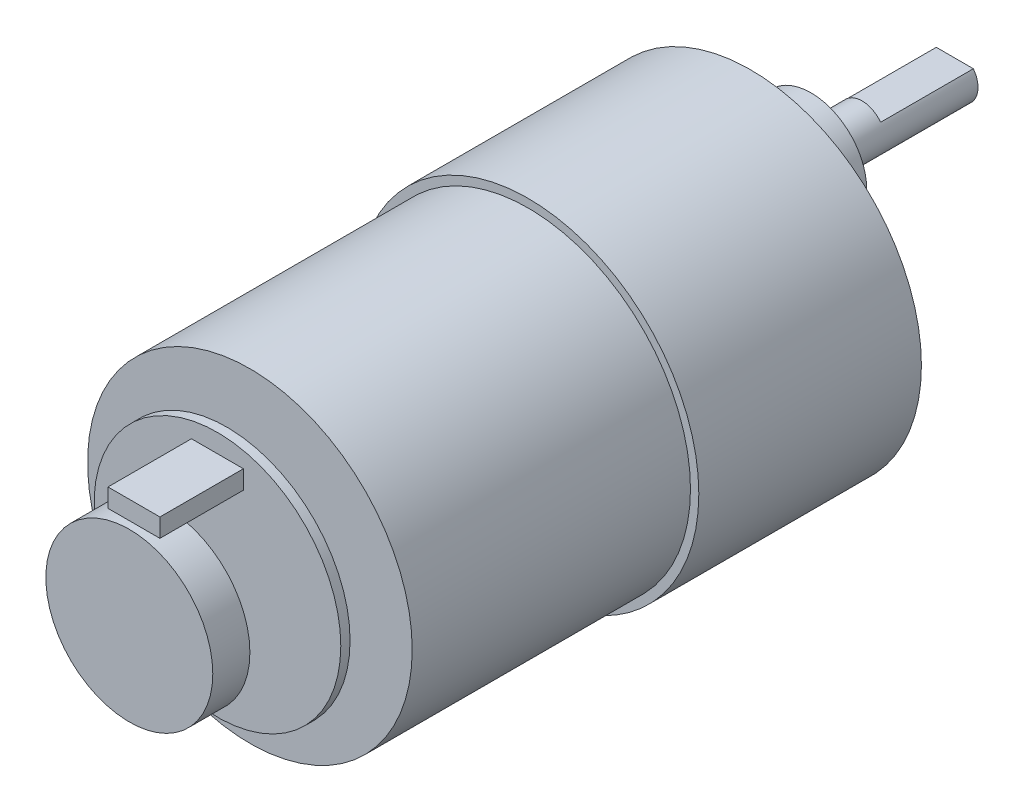
ISO-10303-21;
HEADER;
FILE_DESCRIPTION(('STEP AP214'),'2;1');
FILE_NAME('part.step','',(''),(''),'','','');
FILE_SCHEMA(('AUTOMOTIVE_DESIGN { 1 0 10303 214 1 1 1 1 }'));
ENDSEC;
DATA;
#1=APPLICATION_CONTEXT('core data for automotive mechanical design processes');
#2=APPLICATION_PROTOCOL_DEFINITION('international standard','automotive_design',2000,#1);
#3=PRODUCT_CONTEXT('',#1,'mechanical');
#4=PRODUCT('Part','Part','',(#3));
#5=PRODUCT_RELATED_PRODUCT_CATEGORY('part','',(#4));
#6=PRODUCT_DEFINITION_FORMATION('','',#4);
#7=PRODUCT_DEFINITION_CONTEXT('part definition',#1,'design');
#8=PRODUCT_DEFINITION('design','',#6,#7);
#9=PRODUCT_DEFINITION_SHAPE('','',#8);
#10=(LENGTH_UNIT() NAMED_UNIT(*) SI_UNIT(.MILLI.,.METRE.));
#11=(NAMED_UNIT(*) PLANE_ANGLE_UNIT() SI_UNIT($,.RADIAN.));
#12=(NAMED_UNIT(*) SI_UNIT($,.STERADIAN.) SOLID_ANGLE_UNIT());
#13=UNCERTAINTY_MEASURE_WITH_UNIT(LENGTH_MEASURE(1.E-05),#10,'distance_accuracy_value','');
#14=(GEOMETRIC_REPRESENTATION_CONTEXT(3) GLOBAL_UNCERTAINTY_ASSIGNED_CONTEXT((#13)) GLOBAL_UNIT_ASSIGNED_CONTEXT((#10,
#11,#12)) REPRESENTATION_CONTEXT('',''));
#15=CARTESIAN_POINT('',(0.,0.,0.));
#16=DIRECTION('',(0.,0.,1.));
#17=DIRECTION('',(1.,0.,0.));
#18=AXIS2_PLACEMENT_3D('',#15,#16,#17);
#19=CARTESIAN_POINT('',(0.,7.,-22.));
#20=DIRECTION('',(0.,0.,1.));
#21=DIRECTION('',(1.,0.,0.));
#22=AXIS2_PLACEMENT_3D('',#19,#20,#21);
#23=CYLINDRICAL_SURFACE('',#22,2.5);
#24=CARTESIAN_POINT('',(0.,7.,-6.5));
#25=DIRECTION('',(0.,0.,-1.));
#26=DIRECTION('',(-1.,0.,0.));
#27=AXIS2_PLACEMENT_3D('',#24,#25,#26);
#28=CIRCLE('',#27,2.5);
#29=CARTESIAN_POINT('',(-2.5,7.,-6.5));
#30=VERTEX_POINT('',#29);
#31=EDGE_CURVE('E187',#30,#30,#28,.T.);
#32=ORIENTED_EDGE('',*,*,#31,.T.);
#33=EDGE_LOOP('',(#32));
#34=FACE_BOUND('',#33,.T.);
#35=CARTESIAN_POINT('',(0.,7.,-12.));
#36=DIRECTION('',(0.,0.,-1.));
#37=DIRECTION('',(-1.,0.,0.));
#38=AXIS2_PLACEMENT_3D('',#35,#36,#37);
#39=CIRCLE('',#38,2.5);
#40=CARTESIAN_POINT('',(-2.,8.5,-12.));
#41=VERTEX_POINT('',#40);
#42=CARTESIAN_POINT('',(2.,8.5,-12.));
#43=VERTEX_POINT('',#42);
#44=EDGE_CURVE('E12',#41,#43,#39,.T.);
#45=ORIENTED_EDGE('',*,*,#44,.F.);
#46=DIRECTION('',(0.,0.,-1.));
#47=VECTOR('',#46,1.);
#48=CARTESIAN_POINT('',(-2.,8.5,-12.));
#49=LINE('',#48,#47);
#50=CARTESIAN_POINT('',(-2.,8.5,-22.));
#51=VERTEX_POINT('',#50);
#52=EDGE_CURVE('E85',#41,#51,#49,.T.);
#53=ORIENTED_EDGE('',*,*,#52,.T.);
#54=CARTESIAN_POINT('',(0.,7.,-22.));
#55=DIRECTION('',(0.,0.,-1.));
#56=DIRECTION('',(-1.,0.,0.));
#57=AXIS2_PLACEMENT_3D('',#54,#55,#56);
#58=CIRCLE('',#57,2.5);
#59=CARTESIAN_POINT('',(2.,8.5,-22.));
#60=VERTEX_POINT('',#59);
#61=EDGE_CURVE('E98',#60,#51,#58,.T.);
#62=ORIENTED_EDGE('',*,*,#61,.F.);
#63=DIRECTION('',(0.,0.,-1.));
#64=VECTOR('',#63,1.);
#65=CARTESIAN_POINT('',(2.,8.5,-12.));
#66=LINE('',#65,#64);
#67=EDGE_CURVE('E48',#43,#60,#66,.T.);
#68=ORIENTED_EDGE('',*,*,#67,.F.);
#69=EDGE_LOOP('',(#45,#53,#62,#68));
#70=FACE_BOUND('',#69,.T.);
#71=ADVANCED_FACE('F33',(#34,#70),#23,.T.);
#72=CARTESIAN_POINT('',(0.,7.,-22.));
#73=DIRECTION('',(0.,0.,-1.));
#74=DIRECTION('',(-1.,0.,0.));
#75=AXIS2_PLACEMENT_3D('',#72,#73,#74);
#76=PLANE('',#75);
#77=ORIENTED_EDGE('',*,*,#61,.T.);
#78=DIRECTION('',(1.,0.,0.));
#79=VECTOR('',#78,1.);
#80=CARTESIAN_POINT('',(-2.,8.5,-22.));
#81=LINE('',#80,#79);
#82=EDGE_CURVE('E89',#51,#60,#81,.T.);
#83=ORIENTED_EDGE('',*,*,#82,.T.);
#84=EDGE_LOOP('',(#77,#83));
#85=FACE_BOUND('',#84,.T.);
#86=ADVANCED_FACE('F229',(#85),#76,.T.);
#87=CARTESIAN_POINT('',(0.,0.,57.5));
#88=DIRECTION('',(0.,0.,1.));
#89=DIRECTION('',(1.,0.,0.));
#90=AXIS2_PLACEMENT_3D('',#87,#88,#89);
#91=PLANE('',#90);
#92=CARTESIAN_POINT('',(0.,0.,57.5));
#93=DIRECTION('',(0.,0.,1.));
#94=DIRECTION('',(1.,0.,0.));
#95=AXIS2_PLACEMENT_3D('',#92,#93,#94);
#96=CIRCLE('',#95,1.);
#97=CARTESIAN_POINT('',(1.,0.,57.5));
#98=VERTEX_POINT('',#97);
#99=EDGE_CURVE('E133',#98,#98,#96,.T.);
#100=ORIENTED_EDGE('',*,*,#99,.F.);
#101=EDGE_LOOP('',(#100));
#102=FACE_BOUND('',#101,.T.);
#103=CARTESIAN_POINT('',(0.,0.,57.5));
#104=DIRECTION('',(0.,0.,1.));
#105=DIRECTION('',(1.,0.,0.));
#106=AXIS2_PLACEMENT_3D('',#103,#104,#105);
#107=CIRCLE('',#106,13.3);
#108=CARTESIAN_POINT('',(13.3,0.,57.5));
#109=VERTEX_POINT('',#108);
#110=EDGE_CURVE('E142',#109,#109,#107,.T.);
#111=ORIENTED_EDGE('',*,*,#110,.T.);
#112=EDGE_LOOP('',(#111));
#113=FACE_BOUND('',#112,.T.);
#114=DIRECTION('',(-1.,0.,0.));
#115=VECTOR('',#114,1.);
#116=CARTESIAN_POINT('',(-2.8,11.3,57.5));
#117=LINE('',#116,#115);
#118=CARTESIAN_POINT('',(2.8,11.3,57.5));
#119=VERTEX_POINT('',#118);
#120=CARTESIAN_POINT('',(-2.8,11.3,57.5));
#121=VERTEX_POINT('',#120);
#122=EDGE_CURVE('E102',#119,#121,#117,.T.);
#123=ORIENTED_EDGE('',*,*,#122,.F.);
#124=DIRECTION('',(0.,1.,0.));
#125=VECTOR('',#124,1.);
#126=CARTESIAN_POINT('',(2.8,11.3,57.5));
#127=LINE('',#126,#125);
#128=CARTESIAN_POINT('',(2.8,9.3,57.5));
#129=VERTEX_POINT('',#128);
#130=EDGE_CURVE('E99',#129,#119,#127,.T.);
#131=ORIENTED_EDGE('',*,*,#130,.F.);
#132=DIRECTION('',(1.,0.,0.));
#133=VECTOR('',#132,1.);
#134=CARTESIAN_POINT('',(-2.8,9.3,57.5));
#135=LINE('',#134,#133);
#136=CARTESIAN_POINT('',(-2.8,9.3,57.5));
#137=VERTEX_POINT('',#136);
#138=EDGE_CURVE('E110',#137,#129,#135,.T.);
#139=ORIENTED_EDGE('',*,*,#138,.F.);
#140=DIRECTION('',(0.,-1.,0.));
#141=VECTOR('',#140,1.);
#142=CARTESIAN_POINT('',(-2.8,11.3,57.5));
#143=LINE('',#142,#141);
#144=EDGE_CURVE('E118',#121,#137,#143,.T.);
#145=ORIENTED_EDGE('',*,*,#144,.F.);
#146=EDGE_LOOP('',(#123,#131,#139,#145));
#147=FACE_BOUND('',#146,.T.);
#148=ADVANCED_FACE('F236',(#102,#113,#147),#91,.T.);
#149=CARTESIAN_POINT('',(0.,0.,54.));
#150=DIRECTION('',(0.,0.,1.));
#151=DIRECTION('',(1.,0.,0.));
#152=AXIS2_PLACEMENT_3D('',#149,#150,#151);
#153=PLANE('',#152);
#154=CARTESIAN_POINT('',(0.,0.,54.));
#155=DIRECTION('',(0.,0.,1.));
#156=DIRECTION('',(1.,0.,0.));
#157=AXIS2_PLACEMENT_3D('',#154,#155,#156);
#158=CIRCLE('',#157,17.5);
#159=CARTESIAN_POINT('',(17.5,0.,54.));
#160=VERTEX_POINT('',#159);
#161=EDGE_CURVE('E197',#160,#160,#158,.T.);
#162=ORIENTED_EDGE('',*,*,#161,.T.);
#163=EDGE_LOOP('',(#162));
#164=FACE_BOUND('',#163,.T.);
#165=CARTESIAN_POINT('',(0.,0.,54.));
#166=DIRECTION('',(0.,0.,1.));
#167=DIRECTION('',(1.,0.,0.));
#168=AXIS2_PLACEMENT_3D('',#165,#166,#167);
#169=CIRCLE('',#168,1.);
#170=CARTESIAN_POINT('',(1.,0.,54.));
#171=VERTEX_POINT('',#170);
#172=EDGE_CURVE('E145',#171,#171,#169,.T.);
#173=ORIENTED_EDGE('',*,*,#172,.F.);
#174=EDGE_LOOP('',(#173));
#175=FACE_BOUND('',#174,.T.);
#176=ADVANCED_FACE('F223',(#164,#175),#153,.T.);
#177=CARTESIAN_POINT('',(0.,7.,-6.5));
#178=DIRECTION('',(0.,0.,-1.));
#179=DIRECTION('',(-1.,0.,0.));
#180=AXIS2_PLACEMENT_3D('',#177,#178,#179);
#181=PLANE('',#180);
#182=CARTESIAN_POINT('',(0.,7.,-6.5));
#183=DIRECTION('',(0.,0.,-1.));
#184=DIRECTION('',(-1.,0.,0.));
#185=AXIS2_PLACEMENT_3D('',#182,#183,#184);
#186=CIRCLE('',#185,6.);
#187=CARTESIAN_POINT('',(-6.,7.,-6.5));
#188=VERTEX_POINT('',#187);
#189=EDGE_CURVE('E191',#188,#188,#186,.T.);
#190=ORIENTED_EDGE('',*,*,#189,.T.);
#191=EDGE_LOOP('',(#190));
#192=FACE_BOUND('',#191,.T.);
#193=ORIENTED_EDGE('',*,*,#31,.F.);
#194=EDGE_LOOP('',(#193));
#195=FACE_BOUND('',#194,.T.);
#196=ADVANCED_FACE('F215',(#192,#195),#181,.T.);
#197=CARTESIAN_POINT('',(0.,0.,0.));
#198=DIRECTION('',(0.,0.,1.));
#199=DIRECTION('',(1.,0.,0.));
#200=AXIS2_PLACEMENT_3D('',#197,#198,#199);
#201=PLANE('',#200);
#202=CARTESIAN_POINT('',(7.48592515374054,12.9660027079352,0.));
#203=DIRECTION('',(0.,0.,-1.));
#204=DIRECTION('',(-1.,0.,0.));
#205=AXIS2_PLACEMENT_3D('',#202,#203,#204);
#206=CIRCLE('',#205,1.50000000000132);
#207=CARTESIAN_POINT('',(5.98592515373922,12.9660027079352,0.));
#208=VERTEX_POINT('',#207);
#209=EDGE_CURVE('E151',#208,#208,#206,.T.);
#210=ORIENTED_EDGE('',*,*,#209,.F.);
#211=EDGE_LOOP('',(#210));
#212=FACE_BOUND('',#211,.T.);
#213=CARTESIAN_POINT('',(14.9718503074802,-1.48405593369816E-12,0.));
#214=DIRECTION('',(0.,0.,-1.));
#215=DIRECTION('',(-1.,0.,0.));
#216=AXIS2_PLACEMENT_3D('',#213,#214,#215);
#217=CIRCLE('',#216,1.50000000000132);
#218=CARTESIAN_POINT('',(13.4718503074788,-1.48405593369816E-12,0.));
#219=VERTEX_POINT('',#218);
#220=EDGE_CURVE('E157',#219,#219,#217,.T.);
#221=ORIENTED_EDGE('',*,*,#220,.F.);
#222=EDGE_LOOP('',(#221));
#223=FACE_BOUND('',#222,.T.);
#224=CARTESIAN_POINT('',(7.48592515373903,-12.9660027079373,0.));
#225=DIRECTION('',(0.,0.,-1.));
#226=DIRECTION('',(-1.,0.,0.));
#227=AXIS2_PLACEMENT_3D('',#224,#225,#226);
#228=CIRCLE('',#227,1.50000000000132);
#229=CARTESIAN_POINT('',(5.98592515373771,-12.9660027079373,0.));
#230=VERTEX_POINT('',#229);
#231=EDGE_CURVE('E163',#230,#230,#228,.T.);
#232=ORIENTED_EDGE('',*,*,#231,.F.);
#233=EDGE_LOOP('',(#232));
#234=FACE_BOUND('',#233,.T.);
#235=CARTESIAN_POINT('',(-7.48592515374175,-12.9660027079364,0.));
#236=DIRECTION('',(0.,0.,-1.));
#237=DIRECTION('',(-1.,0.,0.));
#238=AXIS2_PLACEMENT_3D('',#235,#236,#237);
#239=CIRCLE('',#238,1.50000000000132);
#240=CARTESIAN_POINT('',(-8.98592515374308,-12.9660027079364,0.));
#241=VERTEX_POINT('',#240);
#242=EDGE_CURVE('E169',#241,#241,#239,.T.);
#243=ORIENTED_EDGE('',*,*,#242,.F.);
#244=EDGE_LOOP('',(#243));
#245=FACE_BOUND('',#244,.T.);
#246=CARTESIAN_POINT('',(-14.9718503074814,2.64545330086463E-13,0.));
#247=DIRECTION('',(0.,0.,-1.));
#248=DIRECTION('',(-1.,0.,0.));
#249=AXIS2_PLACEMENT_3D('',#246,#247,#248);
#250=CIRCLE('',#249,1.50000000000132);
#251=CARTESIAN_POINT('',(-16.4718503074827,2.64545330086463E-13,0.));
#252=VERTEX_POINT('',#251);
#253=EDGE_CURVE('E175',#252,#252,#250,.T.);
#254=ORIENTED_EDGE('',*,*,#253,.F.);
#255=EDGE_LOOP('',(#254));
#256=FACE_BOUND('',#255,.T.);
#257=CARTESIAN_POINT('',(-7.48592515374025,12.966002707936,0.));
#258=DIRECTION('',(0.,0.,-1.));
#259=DIRECTION('',(-1.,0.,0.));
#260=AXIS2_PLACEMENT_3D('',#257,#258,#259);
#261=CIRCLE('',#260,1.50000000000132);
#262=CARTESIAN_POINT('',(-8.98592515374157,12.966002707936,0.));
#263=VERTEX_POINT('',#262);
#264=EDGE_CURVE('E181',#263,#263,#261,.T.);
#265=ORIENTED_EDGE('',*,*,#264,.F.);
#266=EDGE_LOOP('',(#265));
#267=FACE_BOUND('',#266,.T.);
#268=CARTESIAN_POINT('',(0.,0.,0.));
#269=DIRECTION('',(0.,0.,1.));
#270=DIRECTION('',(1.,0.,0.));
#271=AXIS2_PLACEMENT_3D('',#268,#269,#270);
#272=CIRCLE('',#271,18.4);
#273=CARTESIAN_POINT('',(18.4,0.,0.));
#274=VERTEX_POINT('',#273);
#275=EDGE_CURVE('E200',#274,#274,#272,.T.);
#276=ORIENTED_EDGE('',*,*,#275,.F.);
#277=EDGE_LOOP('',(#276));
#278=FACE_BOUND('',#277,.T.);
#279=CARTESIAN_POINT('',(0.,7.,0.));
#280=DIRECTION('',(0.,0.,1.));
#281=DIRECTION('',(1.,0.,0.));
#282=AXIS2_PLACEMENT_3D('',#279,#280,#281);
#283=CIRCLE('',#282,6.);
#284=CARTESIAN_POINT('',(6.,7.,0.));
#285=VERTEX_POINT('',#284);
#286=EDGE_CURVE('E41',#285,#285,#283,.F.);
#287=ORIENTED_EDGE('',*,*,#286,.F.);
#288=EDGE_LOOP('',(#287));
#289=FACE_BOUND('',#288,.T.);
#290=ADVANCED_FACE('F212',(#212,#223,#234,#245,#256,#267,#278,#289),#201,.F.);
#291=CARTESIAN_POINT('',(0.,0.,24.));
#292=DIRECTION('',(0.,0.,1.));
#293=DIRECTION('',(1.,0.,0.));
#294=AXIS2_PLACEMENT_3D('',#291,#292,#293);
#295=PLANE('',#294);
#296=CARTESIAN_POINT('',(0.,0.,24.));
#297=DIRECTION('',(0.,0.,1.));
#298=DIRECTION('',(1.,0.,0.));
#299=AXIS2_PLACEMENT_3D('',#296,#297,#298);
#300=CIRCLE('',#299,18.4);
#301=CARTESIAN_POINT('',(18.4,0.,24.));
#302=VERTEX_POINT('',#301);
#303=EDGE_CURVE('E203',#302,#302,#300,.T.);
#304=ORIENTED_EDGE('',*,*,#303,.T.);
#305=EDGE_LOOP('',(#304));
#306=FACE_BOUND('',#305,.T.);
#307=CARTESIAN_POINT('',(0.,0.,24.));
#308=DIRECTION('',(0.,0.,1.));
#309=DIRECTION('',(1.,0.,0.));
#310=AXIS2_PLACEMENT_3D('',#307,#308,#309);
#311=CIRCLE('',#310,17.5);
#312=CARTESIAN_POINT('',(17.5,0.,24.));
#313=VERTEX_POINT('',#312);
#314=EDGE_CURVE('E196',#313,#313,#311,.T.);
#315=ORIENTED_EDGE('',*,*,#314,.F.);
#316=EDGE_LOOP('',(#315));
#317=FACE_BOUND('',#316,.T.);
#318=ADVANCED_FACE('F214',(#306,#317),#295,.T.);
#319=CARTESIAN_POINT('',(0.,0.,24.));
#320=DIRECTION('',(0.,0.,-1.));
#321=DIRECTION('',(-1.,0.,0.));
#322=AXIS2_PLACEMENT_3D('',#319,#320,#321);
#323=CYLINDRICAL_SURFACE('',#322,18.4);
#324=ORIENTED_EDGE('',*,*,#303,.F.);
#325=EDGE_LOOP('',(#324));
#326=FACE_BOUND('',#325,.T.);
#327=ORIENTED_EDGE('',*,*,#275,.T.);
#328=EDGE_LOOP('',(#327));
#329=FACE_BOUND('',#328,.T.);
#330=ADVANCED_FACE('F35',(#326,#329),#323,.T.);
#331=CARTESIAN_POINT('',(0.,0.,54.));
#332=DIRECTION('',(0.,0.,-1.));
#333=DIRECTION('',(-1.,0.,0.));
#334=AXIS2_PLACEMENT_3D('',#331,#332,#333);
#335=CYLINDRICAL_SURFACE('',#334,17.5);
#336=ORIENTED_EDGE('',*,*,#161,.F.);
#337=EDGE_LOOP('',(#336));
#338=FACE_BOUND('',#337,.T.);
#339=ORIENTED_EDGE('',*,*,#314,.T.);
#340=EDGE_LOOP('',(#339));
#341=FACE_BOUND('',#340,.T.);
#342=ADVANCED_FACE('F244',(#338,#341),#335,.T.);
#343=CARTESIAN_POINT('',(0.,7.,-6.5));
#344=DIRECTION('',(0.,0.,1.));
#345=DIRECTION('',(1.,0.,0.));
#346=AXIS2_PLACEMENT_3D('',#343,#344,#345);
#347=CYLINDRICAL_SURFACE('',#346,6.);
#348=ORIENTED_EDGE('',*,*,#189,.F.);
#349=EDGE_LOOP('',(#348));
#350=FACE_BOUND('',#349,.T.);
#351=ORIENTED_EDGE('',*,*,#286,.T.);
#352=EDGE_LOOP('',(#351));
#353=FACE_BOUND('',#352,.T.);
#354=ADVANCED_FACE('F210',(#350,#353),#347,.T.);
#355=CARTESIAN_POINT('',(-7.48592515374025,12.966002707936,10.));
#356=DIRECTION('',(0.,0.,-1.));
#357=DIRECTION('',(-1.,0.,0.));
#358=AXIS2_PLACEMENT_3D('',#355,#356,#357);
#359=CYLINDRICAL_SURFACE('',#358,1.50000000000132);
#360=CARTESIAN_POINT('',(-7.48592515374025,12.966002707936,10.));
#361=DIRECTION('',(0.,0.,-1.));
#362=DIRECTION('',(-1.,0.,0.));
#363=AXIS2_PLACEMENT_3D('',#360,#361,#362);
#364=CIRCLE('',#363,1.50000000000132);
#365=CARTESIAN_POINT('',(-8.98592515374157,12.966002707936,10.));
#366=VERTEX_POINT('',#365);
#367=EDGE_CURVE('E184',#366,#366,#364,.T.);
#368=ORIENTED_EDGE('',*,*,#367,.F.);
#369=EDGE_LOOP('',(#368));
#370=FACE_BOUND('',#369,.T.);
#371=ORIENTED_EDGE('',*,*,#264,.T.);
#372=EDGE_LOOP('',(#371));
#373=FACE_BOUND('',#372,.T.);
#374=ADVANCED_FACE('F243',(#370,#373),#359,.F.);
#375=CARTESIAN_POINT('',(-7.48592515374025,12.966002707936,10.));
#376=DIRECTION('',(0.,0.,-1.));
#377=DIRECTION('',(-1.,0.,0.));
#378=AXIS2_PLACEMENT_3D('',#375,#376,#377);
#379=PLANE('',#378);
#380=ORIENTED_EDGE('',*,*,#367,.T.);
#381=EDGE_LOOP('',(#380));
#382=FACE_BOUND('',#381,.T.);
#383=ADVANCED_FACE('F315',(#382),#379,.T.);
#384=CARTESIAN_POINT('',(-14.9718503074814,2.64545330086463E-13,10.));
#385=DIRECTION('',(0.,0.,-1.));
#386=DIRECTION('',(-1.,0.,0.));
#387=AXIS2_PLACEMENT_3D('',#384,#385,#386);
#388=CYLINDRICAL_SURFACE('',#387,1.50000000000132);
#389=CARTESIAN_POINT('',(-14.9718503074814,2.64545330086463E-13,10.));
#390=DIRECTION('',(0.,0.,-1.));
#391=DIRECTION('',(-1.,0.,0.));
#392=AXIS2_PLACEMENT_3D('',#389,#390,#391);
#393=CIRCLE('',#392,1.50000000000132);
#394=CARTESIAN_POINT('',(-16.4718503074827,2.64545330086463E-13,10.));
#395=VERTEX_POINT('',#394);
#396=EDGE_CURVE('E178',#395,#395,#393,.T.);
#397=ORIENTED_EDGE('',*,*,#396,.F.);
#398=EDGE_LOOP('',(#397));
#399=FACE_BOUND('',#398,.T.);
#400=ORIENTED_EDGE('',*,*,#253,.T.);
#401=EDGE_LOOP('',(#400));
#402=FACE_BOUND('',#401,.T.);
#403=ADVANCED_FACE('F311',(#399,#402),#388,.F.);
#404=CARTESIAN_POINT('',(-14.9718503074814,2.64545330086463E-13,10.));
#405=DIRECTION('',(0.,0.,-1.));
#406=DIRECTION('',(-1.,0.,0.));
#407=AXIS2_PLACEMENT_3D('',#404,#405,#406);
#408=PLANE('',#407);
#409=ORIENTED_EDGE('',*,*,#396,.T.);
#410=EDGE_LOOP('',(#409));
#411=FACE_BOUND('',#410,.T.);
#412=ADVANCED_FACE('F307',(#411),#408,.T.);
#413=CARTESIAN_POINT('',(-7.48592515374175,-12.9660027079364,10.));
#414=DIRECTION('',(0.,0.,-1.));
#415=DIRECTION('',(-1.,0.,0.));
#416=AXIS2_PLACEMENT_3D('',#413,#414,#415);
#417=CYLINDRICAL_SURFACE('',#416,1.50000000000132);
#418=CARTESIAN_POINT('',(-7.48592515374175,-12.9660027079364,10.));
#419=DIRECTION('',(0.,0.,-1.));
#420=DIRECTION('',(-1.,0.,0.));
#421=AXIS2_PLACEMENT_3D('',#418,#419,#420);
#422=CIRCLE('',#421,1.50000000000132);
#423=CARTESIAN_POINT('',(-8.98592515374308,-12.9660027079364,10.));
#424=VERTEX_POINT('',#423);
#425=EDGE_CURVE('E172',#424,#424,#422,.T.);
#426=ORIENTED_EDGE('',*,*,#425,.F.);
#427=EDGE_LOOP('',(#426));
#428=FACE_BOUND('',#427,.T.);
#429=ORIENTED_EDGE('',*,*,#242,.T.);
#430=EDGE_LOOP('',(#429));
#431=FACE_BOUND('',#430,.T.);
#432=ADVANCED_FACE('F303',(#428,#431),#417,.F.);
#433=CARTESIAN_POINT('',(-7.48592515374175,-12.9660027079364,10.));
#434=DIRECTION('',(0.,0.,-1.));
#435=DIRECTION('',(-1.,0.,0.));
#436=AXIS2_PLACEMENT_3D('',#433,#434,#435);
#437=PLANE('',#436);
#438=ORIENTED_EDGE('',*,*,#425,.T.);
#439=EDGE_LOOP('',(#438));
#440=FACE_BOUND('',#439,.T.);
#441=ADVANCED_FACE('F299',(#440),#437,.T.);
#442=CARTESIAN_POINT('',(7.48592515373903,-12.9660027079373,10.));
#443=DIRECTION('',(0.,0.,-1.));
#444=DIRECTION('',(-1.,0.,0.));
#445=AXIS2_PLACEMENT_3D('',#442,#443,#444);
#446=CYLINDRICAL_SURFACE('',#445,1.50000000000132);
#447=CARTESIAN_POINT('',(7.48592515373903,-12.9660027079373,10.));
#448=DIRECTION('',(0.,0.,-1.));
#449=DIRECTION('',(-1.,0.,0.));
#450=AXIS2_PLACEMENT_3D('',#447,#448,#449);
#451=CIRCLE('',#450,1.50000000000132);
#452=CARTESIAN_POINT('',(5.98592515373771,-12.9660027079373,10.));
#453=VERTEX_POINT('',#452);
#454=EDGE_CURVE('E166',#453,#453,#451,.T.);
#455=ORIENTED_EDGE('',*,*,#454,.F.);
#456=EDGE_LOOP('',(#455));
#457=FACE_BOUND('',#456,.T.);
#458=ORIENTED_EDGE('',*,*,#231,.T.);
#459=EDGE_LOOP('',(#458));
#460=FACE_BOUND('',#459,.T.);
#461=ADVANCED_FACE('F295',(#457,#460),#446,.F.);
#462=CARTESIAN_POINT('',(7.48592515373903,-12.9660027079373,10.));
#463=DIRECTION('',(0.,0.,-1.));
#464=DIRECTION('',(-1.,0.,0.));
#465=AXIS2_PLACEMENT_3D('',#462,#463,#464);
#466=PLANE('',#465);
#467=ORIENTED_EDGE('',*,*,#454,.T.);
#468=EDGE_LOOP('',(#467));
#469=FACE_BOUND('',#468,.T.);
#470=ADVANCED_FACE('F291',(#469),#466,.T.);
#471=CARTESIAN_POINT('',(14.9718503074802,-1.48405593369816E-12,10.));
#472=DIRECTION('',(0.,0.,-1.));
#473=DIRECTION('',(-1.,0.,0.));
#474=AXIS2_PLACEMENT_3D('',#471,#472,#473);
#475=CYLINDRICAL_SURFACE('',#474,1.50000000000132);
#476=CARTESIAN_POINT('',(14.9718503074802,-1.48405593369816E-12,10.));
#477=DIRECTION('',(0.,0.,-1.));
#478=DIRECTION('',(-1.,0.,0.));
#479=AXIS2_PLACEMENT_3D('',#476,#477,#478);
#480=CIRCLE('',#479,1.50000000000132);
#481=CARTESIAN_POINT('',(13.4718503074788,-1.48405593369816E-12,10.));
#482=VERTEX_POINT('',#481);
#483=EDGE_CURVE('E160',#482,#482,#480,.T.);
#484=ORIENTED_EDGE('',*,*,#483,.F.);
#485=EDGE_LOOP('',(#484));
#486=FACE_BOUND('',#485,.T.);
#487=ORIENTED_EDGE('',*,*,#220,.T.);
#488=EDGE_LOOP('',(#487));
#489=FACE_BOUND('',#488,.T.);
#490=ADVANCED_FACE('F287',(#486,#489),#475,.F.);
#491=CARTESIAN_POINT('',(14.9718503074802,-1.48405593369816E-12,10.));
#492=DIRECTION('',(0.,0.,-1.));
#493=DIRECTION('',(-1.,0.,0.));
#494=AXIS2_PLACEMENT_3D('',#491,#492,#493);
#495=PLANE('',#494);
#496=ORIENTED_EDGE('',*,*,#483,.T.);
#497=EDGE_LOOP('',(#496));
#498=FACE_BOUND('',#497,.T.);
#499=ADVANCED_FACE('F283',(#498),#495,.T.);
#500=CARTESIAN_POINT('',(7.48592515374054,12.9660027079352,10.));
#501=DIRECTION('',(0.,0.,-1.));
#502=DIRECTION('',(-1.,0.,0.));
#503=AXIS2_PLACEMENT_3D('',#500,#501,#502);
#504=CYLINDRICAL_SURFACE('',#503,1.50000000000132);
#505=CARTESIAN_POINT('',(7.48592515374054,12.9660027079352,10.));
#506=DIRECTION('',(0.,0.,-1.));
#507=DIRECTION('',(-1.,0.,0.));
#508=AXIS2_PLACEMENT_3D('',#505,#506,#507);
#509=CIRCLE('',#508,1.50000000000132);
#510=CARTESIAN_POINT('',(5.98592515373922,12.9660027079352,10.));
#511=VERTEX_POINT('',#510);
#512=EDGE_CURVE('E154',#511,#511,#509,.T.);
#513=ORIENTED_EDGE('',*,*,#512,.F.);
#514=EDGE_LOOP('',(#513));
#515=FACE_BOUND('',#514,.T.);
#516=ORIENTED_EDGE('',*,*,#209,.T.);
#517=EDGE_LOOP('',(#516));
#518=FACE_BOUND('',#517,.T.);
#519=ADVANCED_FACE('F275',(#515,#518),#504,.F.);
#520=CARTESIAN_POINT('',(7.48592515374054,12.9660027079352,10.));
#521=DIRECTION('',(0.,0.,-1.));
#522=DIRECTION('',(-1.,0.,0.));
#523=AXIS2_PLACEMENT_3D('',#520,#521,#522);
#524=PLANE('',#523);
#525=ORIENTED_EDGE('',*,*,#512,.T.);
#526=EDGE_LOOP('',(#525));
#527=FACE_BOUND('',#526,.T.);
#528=ADVANCED_FACE('F265',(#527),#524,.T.);
#529=CARTESIAN_POINT('',(0.,0.,56.5));
#530=DIRECTION('',(0.,0.,-1.));
#531=DIRECTION('',(-1.,0.,0.));
#532=AXIS2_PLACEMENT_3D('',#529,#530,#531);
#533=CYLINDRICAL_SURFACE('',#532,1.);
#534=CARTESIAN_POINT('',(0.,0.,56.5));
#535=DIRECTION('',(0.,0.,1.));
#536=DIRECTION('',(1.,0.,0.));
#537=AXIS2_PLACEMENT_3D('',#534,#535,#536);
#538=CIRCLE('',#537,1.);
#539=CARTESIAN_POINT('',(1.,0.,56.5));
#540=VERTEX_POINT('',#539);
#541=EDGE_CURVE('E148',#540,#540,#538,.T.);
#542=ORIENTED_EDGE('',*,*,#541,.F.);
#543=EDGE_LOOP('',(#542));
#544=FACE_BOUND('',#543,.T.);
#545=ORIENTED_EDGE('',*,*,#172,.T.);
#546=EDGE_LOOP('',(#545));
#547=FACE_BOUND('',#546,.T.);
#548=ADVANCED_FACE('F262',(#544,#547),#533,.T.);
#549=CARTESIAN_POINT('',(0.,0.,56.5));
#550=DIRECTION('',(0.,0.,1.));
#551=DIRECTION('',(1.,0.,0.));
#552=AXIS2_PLACEMENT_3D('',#549,#550,#551);
#553=PLANE('',#552);
#554=CARTESIAN_POINT('',(0.,0.,56.5));
#555=DIRECTION('',(0.,0.,1.));
#556=DIRECTION('',(1.,0.,0.));
#557=AXIS2_PLACEMENT_3D('',#554,#555,#556);
#558=CIRCLE('',#557,13.3);
#559=CARTESIAN_POINT('',(13.3,0.,56.5));
#560=VERTEX_POINT('',#559);
#561=EDGE_CURVE('E139',#560,#560,#558,.T.);
#562=ORIENTED_EDGE('',*,*,#561,.F.);
#563=EDGE_LOOP('',(#562));
#564=FACE_BOUND('',#563,.T.);
#565=ORIENTED_EDGE('',*,*,#541,.T.);
#566=EDGE_LOOP('',(#565));
#567=FACE_BOUND('',#566,.T.);
#568=ADVANCED_FACE('F264',(#564,#567),#553,.F.);
#569=CARTESIAN_POINT('',(0.,0.,57.5));
#570=DIRECTION('',(0.,0.,-1.));
#571=DIRECTION('',(-1.,0.,0.));
#572=AXIS2_PLACEMENT_3D('',#569,#570,#571);
#573=CYLINDRICAL_SURFACE('',#572,13.3);
#574=ORIENTED_EDGE('',*,*,#110,.F.);
#575=EDGE_LOOP('',(#574));
#576=FACE_BOUND('',#575,.T.);
#577=ORIENTED_EDGE('',*,*,#561,.T.);
#578=EDGE_LOOP('',(#577));
#579=FACE_BOUND('',#578,.T.);
#580=ADVANCED_FACE('F272',(#576,#579),#573,.T.);
#581=CARTESIAN_POINT('',(0.,0.,63.));
#582=DIRECTION('',(0.,0.,-1.));
#583=DIRECTION('',(-1.,0.,0.));
#584=AXIS2_PLACEMENT_3D('',#581,#582,#583);
#585=CYLINDRICAL_SURFACE('',#584,1.);
#586=CARTESIAN_POINT('',(0.,0.,63.));
#587=DIRECTION('',(0.,0.,1.));
#588=DIRECTION('',(1.,0.,0.));
#589=AXIS2_PLACEMENT_3D('',#586,#587,#588);
#590=CIRCLE('',#589,1.);
#591=CARTESIAN_POINT('',(1.,0.,63.));
#592=VERTEX_POINT('',#591);
#593=EDGE_CURVE('E136',#592,#592,#590,.T.);
#594=ORIENTED_EDGE('',*,*,#593,.F.);
#595=EDGE_LOOP('',(#594));
#596=FACE_BOUND('',#595,.T.);
#597=ORIENTED_EDGE('',*,*,#99,.T.);
#598=EDGE_LOOP('',(#597));
#599=FACE_BOUND('',#598,.T.);
#600=ADVANCED_FACE('F402',(#596,#599),#585,.T.);
#601=CARTESIAN_POINT('',(0.,0.,63.));
#602=DIRECTION('',(0.,0.,1.));
#603=DIRECTION('',(1.,0.,0.));
#604=AXIS2_PLACEMENT_3D('',#601,#602,#603);
#605=PLANE('',#604);
#606=CARTESIAN_POINT('',(0.,0.,63.));
#607=DIRECTION('',(0.,0.,1.));
#608=DIRECTION('',(1.,0.,0.));
#609=AXIS2_PLACEMENT_3D('',#606,#607,#608);
#610=CIRCLE('',#609,9.);
#611=CARTESIAN_POINT('',(9.,0.,63.));
#612=VERTEX_POINT('',#611);
#613=EDGE_CURVE('E129',#612,#612,#610,.T.);
#614=ORIENTED_EDGE('',*,*,#613,.F.);
#615=EDGE_LOOP('',(#614));
#616=FACE_BOUND('',#615,.T.);
#617=ORIENTED_EDGE('',*,*,#593,.T.);
#618=EDGE_LOOP('',(#617));
#619=FACE_BOUND('',#618,.T.);
#620=ADVANCED_FACE('F411',(#616,#619),#605,.F.);
#621=CARTESIAN_POINT('',(0.,0.,67.));
#622=DIRECTION('',(0.,0.,-1.));
#623=DIRECTION('',(-1.,0.,0.));
#624=AXIS2_PLACEMENT_3D('',#621,#622,#623);
#625=CYLINDRICAL_SURFACE('',#624,9.);
#626=CARTESIAN_POINT('',(0.,0.,67.));
#627=DIRECTION('',(0.,0.,1.));
#628=DIRECTION('',(1.,0.,0.));
#629=AXIS2_PLACEMENT_3D('',#626,#627,#628);
#630=CIRCLE('',#629,9.);
#631=CARTESIAN_POINT('',(9.,0.,67.));
#632=VERTEX_POINT('',#631);
#633=EDGE_CURVE('E130',#632,#632,#630,.T.);
#634=ORIENTED_EDGE('',*,*,#633,.F.);
#635=EDGE_LOOP('',(#634));
#636=FACE_BOUND('',#635,.T.);
#637=ORIENTED_EDGE('',*,*,#613,.T.);
#638=EDGE_LOOP('',(#637));
#639=FACE_BOUND('',#638,.T.);
#640=ADVANCED_FACE('F421',(#636,#639),#625,.T.);
#641=CARTESIAN_POINT('',(0.,0.,67.));
#642=DIRECTION('',(0.,0.,1.));
#643=DIRECTION('',(1.,0.,0.));
#644=AXIS2_PLACEMENT_3D('',#641,#642,#643);
#645=PLANE('',#644);
#646=ORIENTED_EDGE('',*,*,#633,.T.);
#647=EDGE_LOOP('',(#646));
#648=FACE_BOUND('',#647,.T.);
#649=ADVANCED_FACE('F431',(#648),#645,.T.);
#650=CARTESIAN_POINT('',(2.8,11.3,66.5));
#651=DIRECTION('',(-1.,0.,0.));
#652=DIRECTION('',(0.,0.,1.));
#653=AXIS2_PLACEMENT_3D('',#650,#651,#652);
#654=PLANE('',#653);
#655=ORIENTED_EDGE('',*,*,#130,.T.);
#656=DIRECTION('',(0.,0.,-1.));
#657=VECTOR('',#656,1.);
#658=CARTESIAN_POINT('',(2.8,11.3,66.5));
#659=LINE('',#658,#657);
#660=CARTESIAN_POINT('',(2.8,11.3,66.5));
#661=VERTEX_POINT('',#660);
#662=EDGE_CURVE('E127',#661,#119,#659,.T.);
#663=ORIENTED_EDGE('',*,*,#662,.F.);
#664=DIRECTION('',(0.,1.,0.));
#665=VECTOR('',#664,1.);
#666=CARTESIAN_POINT('',(2.8,11.3,66.5));
#667=LINE('',#666,#665);
#668=CARTESIAN_POINT('',(2.8,9.3,66.5));
#669=VERTEX_POINT('',#668);
#670=EDGE_CURVE('E106',#669,#661,#667,.T.);
#671=ORIENTED_EDGE('',*,*,#670,.F.);
#672=DIRECTION('',(0.,0.,-1.));
#673=VECTOR('',#672,1.);
#674=CARTESIAN_POINT('',(2.8,9.3,66.5));
#675=LINE('',#674,#673);
#676=EDGE_CURVE('E115',#669,#129,#675,.T.);
#677=ORIENTED_EDGE('',*,*,#676,.T.);
#678=EDGE_LOOP('',(#655,#663,#671,#677));
#679=FACE_BOUND('',#678,.T.);
#680=ADVANCED_FACE('F441',(#679),#654,.F.);
#681=CARTESIAN_POINT('',(-2.8,11.3,66.5));
#682=DIRECTION('',(0.,-1.,0.));
#683=DIRECTION('',(0.,0.,-1.));
#684=AXIS2_PLACEMENT_3D('',#681,#682,#683);
#685=PLANE('',#684);
#686=ORIENTED_EDGE('',*,*,#122,.T.);
#687=DIRECTION('',(0.,0.,-1.));
#688=VECTOR('',#687,1.);
#689=CARTESIAN_POINT('',(-2.8,11.3,66.5));
#690=LINE('',#689,#688);
#691=CARTESIAN_POINT('',(-2.8,11.3,66.5));
#692=VERTEX_POINT('',#691);
#693=EDGE_CURVE('E124',#692,#121,#690,.T.);
#694=ORIENTED_EDGE('',*,*,#693,.F.);
#695=DIRECTION('',(-1.,0.,0.));
#696=VECTOR('',#695,1.);
#697=CARTESIAN_POINT('',(-2.8,11.3,66.5));
#698=LINE('',#697,#696);
#699=EDGE_CURVE('E109',#661,#692,#698,.T.);
#700=ORIENTED_EDGE('',*,*,#699,.F.);
#701=ORIENTED_EDGE('',*,*,#662,.T.);
#702=EDGE_LOOP('',(#686,#694,#700,#701));
#703=FACE_BOUND('',#702,.T.);
#704=ADVANCED_FACE('F459',(#703),#685,.F.);
#705=CARTESIAN_POINT('',(-2.8,11.3,66.5));
#706=DIRECTION('',(1.,0.,0.));
#707=DIRECTION('',(0.,0.,-1.));
#708=AXIS2_PLACEMENT_3D('',#705,#706,#707);
#709=PLANE('',#708);
#710=ORIENTED_EDGE('',*,*,#144,.T.);
#711=DIRECTION('',(0.,0.,-1.));
#712=VECTOR('',#711,1.);
#713=CARTESIAN_POINT('',(-2.8,9.3,66.5));
#714=LINE('',#713,#712);
#715=CARTESIAN_POINT('',(-2.8,9.3,66.5));
#716=VERTEX_POINT('',#715);
#717=EDGE_CURVE('E56',#716,#137,#714,.T.);
#718=ORIENTED_EDGE('',*,*,#717,.F.);
#719=DIRECTION('',(0.,-1.,0.));
#720=VECTOR('',#719,1.);
#721=CARTESIAN_POINT('',(-2.8,11.3,66.5));
#722=LINE('',#721,#720);
#723=EDGE_CURVE('E112',#692,#716,#722,.T.);
#724=ORIENTED_EDGE('',*,*,#723,.F.);
#725=ORIENTED_EDGE('',*,*,#693,.T.);
#726=EDGE_LOOP('',(#710,#718,#724,#725));
#727=FACE_BOUND('',#726,.T.);
#728=ADVANCED_FACE('F469',(#727),#709,.F.);
#729=CARTESIAN_POINT('',(-2.8,9.3,66.5));
#730=DIRECTION('',(0.,1.,0.));
#731=DIRECTION('',(0.,0.,1.));
#732=AXIS2_PLACEMENT_3D('',#729,#730,#731);
#733=PLANE('',#732);
#734=ORIENTED_EDGE('',*,*,#138,.T.);
#735=ORIENTED_EDGE('',*,*,#676,.F.);
#736=DIRECTION('',(1.,0.,0.));
#737=VECTOR('',#736,1.);
#738=CARTESIAN_POINT('',(-2.8,9.3,66.5));
#739=LINE('',#738,#737);
#740=EDGE_CURVE('E114',#716,#669,#739,.T.);
#741=ORIENTED_EDGE('',*,*,#740,.F.);
#742=ORIENTED_EDGE('',*,*,#717,.T.);
#743=EDGE_LOOP('',(#734,#735,#741,#742));
#744=FACE_BOUND('',#743,.T.);
#745=ADVANCED_FACE('F479',(#744),#733,.F.);
#746=CARTESIAN_POINT('',(0.,0.,66.5));
#747=DIRECTION('',(0.,0.,1.));
#748=DIRECTION('',(1.,0.,0.));
#749=AXIS2_PLACEMENT_3D('',#746,#747,#748);
#750=PLANE('',#749);
#751=ORIENTED_EDGE('',*,*,#670,.T.);
#752=ORIENTED_EDGE('',*,*,#699,.T.);
#753=ORIENTED_EDGE('',*,*,#723,.T.);
#754=ORIENTED_EDGE('',*,*,#740,.T.);
#755=EDGE_LOOP('',(#751,#752,#753,#754));
#756=FACE_BOUND('',#755,.T.);
#757=ADVANCED_FACE('F488',(#756),#750,.T.);
#758=CARTESIAN_POINT('',(0.,0.,-12.));
#759=DIRECTION('',(0.,0.,-1.));
#760=DIRECTION('',(-1.,0.,0.));
#761=AXIS2_PLACEMENT_3D('',#758,#759,#760);
#762=PLANE('',#761);
#763=ORIENTED_EDGE('',*,*,#44,.T.);
#764=DIRECTION('',(1.,0.,0.));
#765=VECTOR('',#764,1.);
#766=CARTESIAN_POINT('',(-2.,8.5,-12.));
#767=LINE('',#766,#765);
#768=EDGE_CURVE('E88',#41,#43,#767,.T.);
#769=ORIENTED_EDGE('',*,*,#768,.F.);
#770=EDGE_LOOP('',(#763,#769));
#771=FACE_BOUND('',#770,.T.);
#772=ADVANCED_FACE('F96',(#771),#762,.T.);
#773=CARTESIAN_POINT('',(-2.,8.5,-12.));
#774=DIRECTION('',(0.,1.,0.));
#775=DIRECTION('',(0.,0.,1.));
#776=AXIS2_PLACEMENT_3D('',#773,#774,#775);
#777=PLANE('',#776);
#778=ORIENTED_EDGE('',*,*,#82,.F.);
#779=ORIENTED_EDGE('',*,*,#52,.F.);
#780=ORIENTED_EDGE('',*,*,#768,.T.);
#781=ORIENTED_EDGE('',*,*,#67,.T.);
#782=EDGE_LOOP('',(#778,#779,#780,#781));
#783=FACE_BOUND('',#782,.T.);
#784=ADVANCED_FACE('F87',(#783),#777,.T.);
#785=CLOSED_SHELL('',(#71,#86,#148,#176,#196,#290,#318,#330,#342,#354,#374,#383,#403,#412,#432,
#441,#461,#470,#490,#499,#519,#528,#548,#568,#580,#600,#620,#640,#649,#680,#704,#728,#745,#757,
#772,#784));
#786=MANIFOLD_SOLID_BREP('B2',#785);
#787=ADVANCED_BREP_SHAPE_REPRESENTATION('',(#18,#786),#14);
#788=SHAPE_DEFINITION_REPRESENTATION(#9,#787);
ENDSEC;
END-ISO-10303-21;
